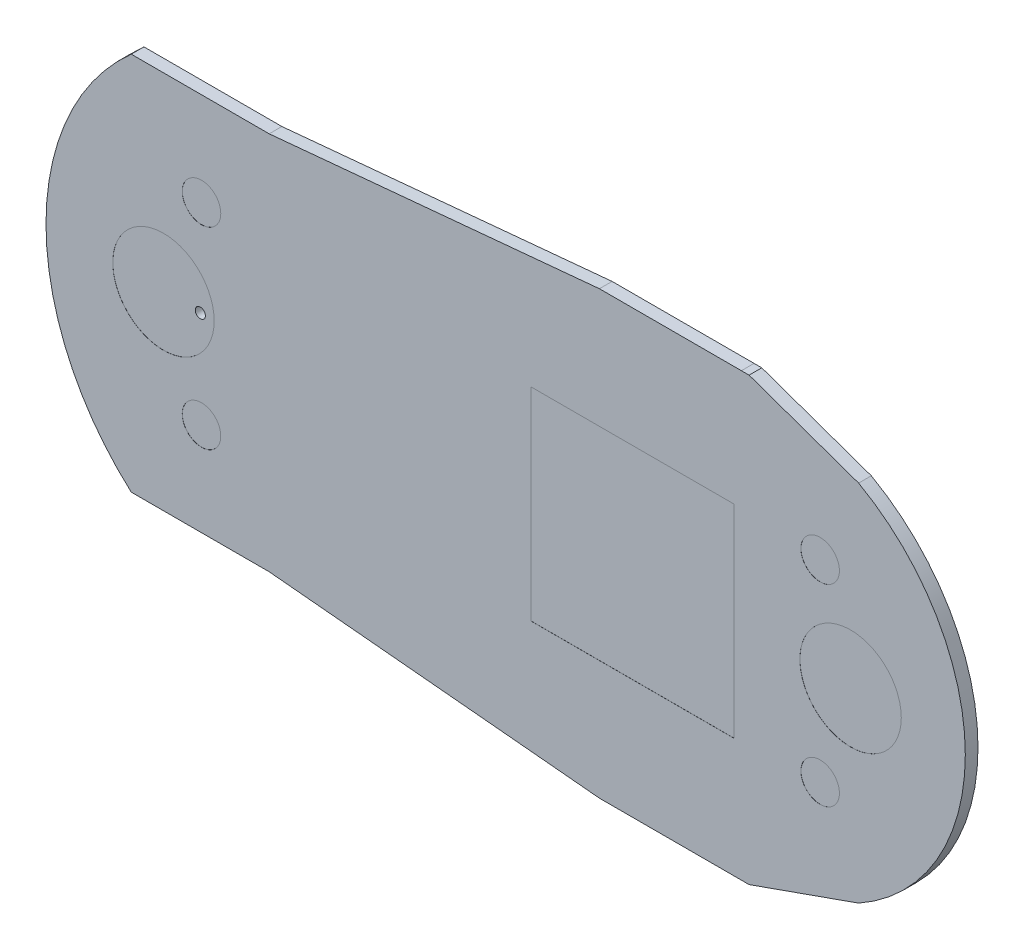
ISO-10303-21;
HEADER;
FILE_DESCRIPTION(('STEP AP214'),'2;1');
FILE_NAME('part.step','',(''),(''),'','','');
FILE_SCHEMA(('AUTOMOTIVE_DESIGN { 1 0 10303 214 1 1 1 1 }'));
ENDSEC;
DATA;
#1=APPLICATION_CONTEXT('core data for automotive mechanical design processes');
#2=APPLICATION_PROTOCOL_DEFINITION('international standard','automotive_design',2000,#1);
#3=PRODUCT_CONTEXT('',#1,'mechanical');
#4=PRODUCT('Part','Part','',(#3));
#5=PRODUCT_RELATED_PRODUCT_CATEGORY('part','',(#4));
#6=PRODUCT_DEFINITION_FORMATION('','',#4);
#7=PRODUCT_DEFINITION_CONTEXT('part definition',#1,'design');
#8=PRODUCT_DEFINITION('design','',#6,#7);
#9=PRODUCT_DEFINITION_SHAPE('','',#8);
#10=(LENGTH_UNIT() NAMED_UNIT(*) SI_UNIT(.MILLI.,.METRE.));
#11=(NAMED_UNIT(*) PLANE_ANGLE_UNIT() SI_UNIT($,.RADIAN.));
#12=(NAMED_UNIT(*) SI_UNIT($,.STERADIAN.) SOLID_ANGLE_UNIT());
#13=UNCERTAINTY_MEASURE_WITH_UNIT(LENGTH_MEASURE(1.E-05),#10,'distance_accuracy_value','');
#14=(GEOMETRIC_REPRESENTATION_CONTEXT(3) GLOBAL_UNCERTAINTY_ASSIGNED_CONTEXT((#13)) GLOBAL_UNIT_ASSIGNED_CONTEXT((#10,
#11,#12)) REPRESENTATION_CONTEXT('',''));
#15=CARTESIAN_POINT('',(0.,0.,0.));
#16=DIRECTION('',(0.,0.,1.));
#17=DIRECTION('',(1.,0.,0.));
#18=AXIS2_PLACEMENT_3D('',#15,#16,#17);
#19=CARTESIAN_POINT('',(122.626549398508,-30.4550148476976,-35.39998));
#20=DIRECTION('',(0.,0.,-1.));
#21=DIRECTION('',(-1.,0.,0.));
#22=AXIS2_PLACEMENT_3D('',#19,#20,#21);
#23=PLANE('',#22);
#24=DIRECTION('',(-0.995634568949673,-0.0933370511233262,0.));
#25=VECTOR('',#24,1.);
#26=CARTESIAN_POINT('',(61.5582408342437,55.2511691061694,-35.39998));
#27=LINE('',#26,#25);
#28=CARTESIAN_POINT('',(61.5582408342434,55.2511691061693,-35.39998));
#29=VERTEX_POINT('',#28);
#30=CARTESIAN_POINT('',(-21.1455,47.4979998942169,-35.39998));
#31=VERTEX_POINT('',#30);
#32=EDGE_CURVE('E184',#29,#31,#27,.T.);
#33=ORIENTED_EDGE('',*,*,#32,.F.);
#34=DIRECTION('',(1.,0.,0.));
#35=VECTOR('',#34,1.);
#36=CARTESIAN_POINT('',(61.5582408342434,55.2511691061693,-35.39998));
#37=LINE('',#36,#35);
#38=CARTESIAN_POINT('',(97.1182408342434,55.2511691061693,-35.39998));
#39=VERTEX_POINT('',#38);
#40=EDGE_CURVE('E280',#29,#39,#37,.T.);
#41=ORIENTED_EDGE('',*,*,#40,.T.);
#42=DIRECTION('',(-0.999999993576027,0.000113348779275702,0.));
#43=VECTOR('',#42,1.);
#44=CARTESIAN_POINT('',(99.0433171406937,55.2509509011186,-35.39998));
#45=LINE('',#44,#43);
#46=CARTESIAN_POINT('',(99.0433171406937,55.2509509011186,-35.39998));
#47=VERTEX_POINT('',#46);
#48=EDGE_CURVE('E185',#47,#39,#45,.T.);
#49=ORIENTED_EDGE('',*,*,#48,.F.);
#50=DIRECTION('',(-0.942838845512373,0.333249023093687,0.));
#51=VECTOR('',#50,1.);
#52=CARTESIAN_POINT('',(126.475317140709,45.5550338894014,-35.39998));
#53=LINE('',#52,#51);
#54=CARTESIAN_POINT('',(126.475317140709,45.5550338894014,-35.39998));
#55=VERTEX_POINT('',#54);
#56=EDGE_CURVE('E298',#55,#47,#53,.T.);
#57=ORIENTED_EDGE('',*,*,#56,.F.);
#58=CARTESIAN_POINT('',(101.009015662051,0.,-35.39998));
#59=DIRECTION('',(0.,0.,-1.));
#60=DIRECTION('',(-1.,0.,0.));
#61=AXIS2_PLACEMENT_3D('',#58,#59,#60);
#62=CIRCLE('',#61,52.1899762757795);
#63=CARTESIAN_POINT('',(126.475317140709,-45.5550338894012,-35.39998));
#64=VERTEX_POINT('',#63);
#65=EDGE_CURVE('E303',#64,#55,#62,.F.);
#66=ORIENTED_EDGE('',*,*,#65,.F.);
#67=DIRECTION('',(0.942838845512372,0.333249023093688,0.));
#68=VECTOR('',#67,1.);
#69=CARTESIAN_POINT('',(99.0433171406938,-55.2509509011184,-35.39998));
#70=LINE('',#69,#68);
#71=CARTESIAN_POINT('',(99.0433171406938,-55.2509509011184,-35.39998));
#72=VERTEX_POINT('',#71);
#73=EDGE_CURVE('E307',#72,#64,#70,.T.);
#74=ORIENTED_EDGE('',*,*,#73,.F.);
#75=DIRECTION('',(0.999999993576027,0.000113348779272105,0.));
#76=VECTOR('',#75,1.);
#77=CARTESIAN_POINT('',(97.1182408342439,-55.2511691061692,-35.39998));
#78=LINE('',#77,#76);
#79=CARTESIAN_POINT('',(97.1182408342439,-55.2511691061692,-35.39998));
#80=VERTEX_POINT('',#79);
#81=EDGE_CURVE('E312',#80,#72,#78,.T.);
#82=ORIENTED_EDGE('',*,*,#81,.F.);
#83=DIRECTION('',(1.,0.,0.));
#84=VECTOR('',#83,1.);
#85=CARTESIAN_POINT('',(61.5582408342434,-55.2511691061693,-35.39998));
#86=LINE('',#85,#84);
#87=CARTESIAN_POINT('',(61.5582408342437,-55.2511691061692,-35.39998));
#88=VERTEX_POINT('',#87);
#89=EDGE_CURVE('E358',#88,#80,#86,.T.);
#90=ORIENTED_EDGE('',*,*,#89,.F.);
#91=DIRECTION('',(0.995634568949674,-0.0933370511233254,0.));
#92=VECTOR('',#91,1.);
#93=CARTESIAN_POINT('',(-21.1454999999997,-47.4979998942169,-35.39998));
#94=LINE('',#93,#92);
#95=CARTESIAN_POINT('',(-21.1454999999997,-47.4979998942169,-35.39998));
#96=VERTEX_POINT('',#95);
#97=EDGE_CURVE('E188',#96,#88,#94,.T.);
#98=ORIENTED_EDGE('',*,*,#97,.F.);
#99=DIRECTION('',(1.,0.,0.));
#100=VECTOR('',#99,1.);
#101=CARTESIAN_POINT('',(-27.94,-47.4979998942169,-35.39998));
#102=LINE('',#101,#100);
#103=CARTESIAN_POINT('',(-55.6894999999997,-47.4979998942169,-35.39998));
#104=VERTEX_POINT('',#103);
#105=EDGE_CURVE('E202',#104,#96,#102,.T.);
#106=ORIENTED_EDGE('',*,*,#105,.F.);
#107=CARTESIAN_POINT('',(-13.5446307268727,0.,-35.39998));
#108=DIRECTION('',(0.,0.,-1.));
#109=DIRECTION('',(-1.,0.,0.));
#110=AXIS2_PLACEMENT_3D('',#107,#108,#109);
#111=CIRCLE('',#110,63.5);
#112=CARTESIAN_POINT('',(-55.6894999999997,47.4979998942169,-35.39998));
#113=VERTEX_POINT('',#112);
#114=EDGE_CURVE('E337',#113,#104,#111,.F.);
#115=ORIENTED_EDGE('',*,*,#114,.F.);
#116=DIRECTION('',(1.,0.,0.));
#117=VECTOR('',#116,1.);
#118=CARTESIAN_POINT('',(-48.895,47.4979998942169,-35.39998));
#119=LINE('',#118,#117);
#120=EDGE_CURVE('E175',#113,#31,#119,.T.);
#121=ORIENTED_EDGE('',*,*,#120,.T.);
#122=EDGE_LOOP('',(#33,#41,#49,#57,#66,#74,#82,#90,#98,#106,#115,#121));
#123=FACE_BOUND('',#122,.T.);
#124=ADVANCED_FACE('F50',(#123),#23,.T.);
#125=CARTESIAN_POINT('',(122.626549398508,-30.4550148476976,-32.22498));
#126=DIRECTION('',(0.,0.,-1.));
#127=DIRECTION('',(-1.,0.,0.));
#128=AXIS2_PLACEMENT_3D('',#125,#126,#127);
#129=PLANE('',#128);
#130=CARTESIAN_POINT('',(-13.5446307268727,0.,-32.22498));
#131=DIRECTION('',(0.,0.,1.));
#132=DIRECTION('',(1.,0.,0.));
#133=AXIS2_PLACEMENT_3D('',#130,#131,#132);
#134=CIRCLE('',#133,63.5);
#135=CARTESIAN_POINT('',(-55.6895,47.4979998942169,-32.22498));
#136=VERTEX_POINT('',#135);
#137=CARTESIAN_POINT('',(-55.6894999999997,-47.4979998942169,-32.22498));
#138=VERTEX_POINT('',#137);
#139=EDGE_CURVE('E327',#136,#138,#134,.T.);
#140=ORIENTED_EDGE('',*,*,#139,.T.);
#141=DIRECTION('',(1.,0.,0.));
#142=VECTOR('',#141,1.);
#143=CARTESIAN_POINT('',(-27.94,-47.4979998942169,-32.22498));
#144=LINE('',#143,#142);
#145=CARTESIAN_POINT('',(-21.1455,-47.4979998942169,-32.22498));
#146=VERTEX_POINT('',#145);
#147=EDGE_CURVE('E209',#138,#146,#144,.T.);
#148=ORIENTED_EDGE('',*,*,#147,.T.);
#149=DIRECTION('',(0.995634568949673,-0.0933370511233254,0.));
#150=VECTOR('',#149,1.);
#151=CARTESIAN_POINT('',(-21.1454999999997,-47.4979998942169,-32.22498));
#152=LINE('',#151,#150);
#153=CARTESIAN_POINT('',(61.5582408342437,-55.2511691061692,-32.22498));
#154=VERTEX_POINT('',#153);
#155=EDGE_CURVE('E190',#146,#154,#152,.T.);
#156=ORIENTED_EDGE('',*,*,#155,.T.);
#157=DIRECTION('',(-1.,0.,0.));
#158=VECTOR('',#157,1.);
#159=CARTESIAN_POINT('',(61.5582408342434,-55.2511691061693,-32.22498));
#160=LINE('',#159,#158);
#161=CARTESIAN_POINT('',(97.1182408342439,-55.2511691061692,-32.22498));
#162=VERTEX_POINT('',#161);
#163=EDGE_CURVE('E59',#162,#154,#160,.T.);
#164=ORIENTED_EDGE('',*,*,#163,.F.);
#165=DIRECTION('',(0.999999993576027,0.000113348779272105,0.));
#166=VECTOR('',#165,1.);
#167=CARTESIAN_POINT('',(97.1182408342439,-55.2511691061692,-32.22498));
#168=LINE('',#167,#166);
#169=CARTESIAN_POINT('',(99.0433171406938,-55.2509509011184,-32.22498));
#170=VERTEX_POINT('',#169);
#171=EDGE_CURVE('E348',#162,#170,#168,.T.);
#172=ORIENTED_EDGE('',*,*,#171,.T.);
#173=DIRECTION('',(0.942838845512372,0.333249023093688,0.));
#174=VECTOR('',#173,1.);
#175=CARTESIAN_POINT('',(99.0433171406938,-55.2509509011184,-32.22498));
#176=LINE('',#175,#174);
#177=CARTESIAN_POINT('',(126.475317140709,-45.5550338894012,-32.22498));
#178=VERTEX_POINT('',#177);
#179=EDGE_CURVE('E346',#170,#178,#176,.T.);
#180=ORIENTED_EDGE('',*,*,#179,.T.);
#181=CARTESIAN_POINT('',(101.009015662051,0.,-32.22498));
#182=DIRECTION('',(0.,0.,1.));
#183=DIRECTION('',(1.,0.,0.));
#184=AXIS2_PLACEMENT_3D('',#181,#182,#183);
#185=CIRCLE('',#184,52.1899762757795);
#186=CARTESIAN_POINT('',(126.475317140709,45.5550338894014,-32.22498));
#187=VERTEX_POINT('',#186);
#188=EDGE_CURVE('E343',#178,#187,#185,.T.);
#189=ORIENTED_EDGE('',*,*,#188,.T.);
#190=DIRECTION('',(-0.942838845512372,0.333249023093687,0.));
#191=VECTOR('',#190,1.);
#192=CARTESIAN_POINT('',(126.475317140709,45.5550338894014,-32.22498));
#193=LINE('',#192,#191);
#194=CARTESIAN_POINT('',(99.0433171406937,55.2509509011186,-32.22498));
#195=VERTEX_POINT('',#194);
#196=EDGE_CURVE('E316',#187,#195,#193,.T.);
#197=ORIENTED_EDGE('',*,*,#196,.T.);
#198=DIRECTION('',(-0.999999993576027,0.000113348779275702,0.));
#199=VECTOR('',#198,1.);
#200=CARTESIAN_POINT('',(99.0433171406937,55.2509509011186,-32.22498));
#201=LINE('',#200,#199);
#202=CARTESIAN_POINT('',(97.1182408342437,55.2511691061694,-32.22498));
#203=VERTEX_POINT('',#202);
#204=EDGE_CURVE('E296',#195,#203,#201,.T.);
#205=ORIENTED_EDGE('',*,*,#204,.T.);
#206=DIRECTION('',(-1.,0.,0.));
#207=VECTOR('',#206,1.);
#208=CARTESIAN_POINT('',(61.5582408342434,55.2511691061693,-32.22498));
#209=LINE('',#208,#207);
#210=CARTESIAN_POINT('',(61.5582408342434,55.2511691061693,-32.22498));
#211=VERTEX_POINT('',#210);
#212=EDGE_CURVE('E74',#203,#211,#209,.T.);
#213=ORIENTED_EDGE('',*,*,#212,.T.);
#214=DIRECTION('',(-0.995634568949673,-0.0933370511233262,0.));
#215=VECTOR('',#214,1.);
#216=CARTESIAN_POINT('',(61.5582408342437,55.2511691061694,-32.22498));
#217=LINE('',#216,#215);
#218=CARTESIAN_POINT('',(-21.1454999999997,47.497999894217,-32.22498));
#219=VERTEX_POINT('',#218);
#220=EDGE_CURVE('E182',#211,#219,#217,.T.);
#221=ORIENTED_EDGE('',*,*,#220,.T.);
#222=DIRECTION('',(1.,0.,0.));
#223=VECTOR('',#222,1.);
#224=CARTESIAN_POINT('',(-48.895,47.4979998942169,-32.22498));
#225=LINE('',#224,#223);
#226=EDGE_CURVE('E166',#136,#219,#225,.T.);
#227=ORIENTED_EDGE('',*,*,#226,.F.);
#228=EDGE_LOOP('',(#140,#148,#156,#164,#172,#180,#189,#197,#205,#213,#221,#227));
#229=FACE_BOUND('',#228,.T.);
#230=CARTESIAN_POINT('',(-38.1,24.13,-32.22498));
#231=DIRECTION('',(0.,0.,1.));
#232=DIRECTION('',(1.,0.,0.));
#233=AXIS2_PLACEMENT_3D('',#230,#231,#232);
#234=CIRCLE('',#233,4.82599999999999);
#235=CARTESIAN_POINT('',(-33.274,24.13,-32.22498));
#236=VERTEX_POINT('',#235);
#237=EDGE_CURVE('E230',#236,#236,#234,.T.);
#238=ORIENTED_EDGE('',*,*,#237,.F.);
#239=EDGE_LOOP('',(#238));
#240=FACE_BOUND('',#239,.T.);
#241=CARTESIAN_POINT('',(124.46,0.,-32.22498));
#242=DIRECTION('',(0.,0.,1.));
#243=DIRECTION('',(1.,0.,0.));
#244=AXIS2_PLACEMENT_3D('',#241,#242,#243);
#245=CIRCLE('',#244,12.7);
#246=CARTESIAN_POINT('',(137.16,0.,-32.22498));
#247=VERTEX_POINT('',#246);
#248=EDGE_CURVE('E222',#247,#247,#245,.T.);
#249=ORIENTED_EDGE('',*,*,#248,.F.);
#250=EDGE_LOOP('',(#249));
#251=FACE_BOUND('',#250,.T.);
#252=CARTESIAN_POINT('',(-47.625,0.,-32.22498));
#253=DIRECTION('',(0.,0.,1.));
#254=DIRECTION('',(1.,0.,0.));
#255=AXIS2_PLACEMENT_3D('',#252,#253,#254);
#256=CIRCLE('',#255,12.7);
#257=CARTESIAN_POINT('',(-34.925,0.,-32.22498));
#258=VERTEX_POINT('',#257);
#259=EDGE_CURVE('E215',#258,#258,#256,.T.);
#260=ORIENTED_EDGE('',*,*,#259,.F.);
#261=EDGE_LOOP('',(#260));
#262=FACE_BOUND('',#261,.T.);
#263=DIRECTION('',(-1.,0.,0.));
#264=VECTOR('',#263,1.);
#265=CARTESIAN_POINT('',(44.45,25.4,-32.22498));
#266=LINE('',#265,#264);
#267=CARTESIAN_POINT('',(95.25,25.4,-32.22498));
#268=VERTEX_POINT('',#267);
#269=CARTESIAN_POINT('',(44.45,25.4,-32.22498));
#270=VERTEX_POINT('',#269);
#271=EDGE_CURVE('E261',#268,#270,#266,.T.);
#272=ORIENTED_EDGE('',*,*,#271,.F.);
#273=DIRECTION('',(0.,1.,0.));
#274=VECTOR('',#273,1.);
#275=CARTESIAN_POINT('',(95.25,-25.4,-32.22498));
#276=LINE('',#275,#274);
#277=CARTESIAN_POINT('',(95.25,-25.4,-32.22498));
#278=VERTEX_POINT('',#277);
#279=EDGE_CURVE('E66',#278,#268,#276,.T.);
#280=ORIENTED_EDGE('',*,*,#279,.F.);
#281=DIRECTION('',(1.,0.,0.));
#282=VECTOR('',#281,1.);
#283=CARTESIAN_POINT('',(44.45,-25.4,-32.22498));
#284=LINE('',#283,#282);
#285=CARTESIAN_POINT('',(44.45,-25.4,-32.22498));
#286=VERTEX_POINT('',#285);
#287=EDGE_CURVE('E254',#286,#278,#284,.T.);
#288=ORIENTED_EDGE('',*,*,#287,.F.);
#289=DIRECTION('',(0.,-1.,0.));
#290=VECTOR('',#289,1.);
#291=CARTESIAN_POINT('',(44.45,-25.4,-32.22498));
#292=LINE('',#291,#290);
#293=EDGE_CURVE('E257',#270,#286,#292,.T.);
#294=ORIENTED_EDGE('',*,*,#293,.F.);
#295=EDGE_LOOP('',(#272,#280,#288,#294));
#296=FACE_BOUND('',#295,.T.);
#297=CARTESIAN_POINT('',(-38.1,-24.13,-32.22498));
#298=DIRECTION('',(0.,0.,1.));
#299=DIRECTION('',(-1.,0.,0.));
#300=AXIS2_PLACEMENT_3D('',#297,#298,#299);
#301=CIRCLE('',#300,4.82599999999999);
#302=CARTESIAN_POINT('',(-42.926,-24.13,-32.22498));
#303=VERTEX_POINT('',#302);
#304=EDGE_CURVE('E240',#303,#303,#301,.T.);
#305=ORIENTED_EDGE('',*,*,#304,.F.);
#306=EDGE_LOOP('',(#305));
#307=FACE_BOUND('',#306,.T.);
#308=CARTESIAN_POINT('',(116.84,-24.13,-32.22498));
#309=DIRECTION('',(0.,0.,1.));
#310=DIRECTION('',(-1.,0.,0.));
#311=AXIS2_PLACEMENT_3D('',#308,#309,#310);
#312=CIRCLE('',#311,4.82599999999999);
#313=CARTESIAN_POINT('',(112.014,-24.13,-32.22498));
#314=VERTEX_POINT('',#313);
#315=EDGE_CURVE('E234',#314,#314,#312,.T.);
#316=ORIENTED_EDGE('',*,*,#315,.F.);
#317=EDGE_LOOP('',(#316));
#318=FACE_BOUND('',#317,.T.);
#319=CARTESIAN_POINT('',(116.84,24.13,-32.22498));
#320=DIRECTION('',(0.,0.,1.));
#321=DIRECTION('',(1.,0.,0.));
#322=AXIS2_PLACEMENT_3D('',#319,#320,#321);
#323=CIRCLE('',#322,4.82599999999999);
#324=CARTESIAN_POINT('',(121.666,24.13,-32.22498));
#325=VERTEX_POINT('',#324);
#326=EDGE_CURVE('E227',#325,#325,#323,.T.);
#327=ORIENTED_EDGE('',*,*,#326,.F.);
#328=EDGE_LOOP('',(#327));
#329=FACE_BOUND('',#328,.T.);
#330=ADVANCED_FACE('F52',(#229,#240,#251,#262,#296,#307,#318,#329),#129,.F.);
#331=CARTESIAN_POINT('',(61.5582408342434,-55.2511691061693,9.23690671004311));
#332=DIRECTION('',(0.,1.,0.));
#333=DIRECTION('',(0.,0.,1.));
#334=AXIS2_PLACEMENT_3D('',#331,#332,#333);
#335=PLANE('',#334);
#336=DIRECTION('',(0.,0.,-1.));
#337=VECTOR('',#336,1.);
#338=CARTESIAN_POINT('',(97.1182408342434,-55.2511691061693,9.23690671004311));
#339=LINE('',#338,#337);
#340=EDGE_CURVE('E361',#162,#80,#339,.T.);
#341=ORIENTED_EDGE('',*,*,#340,.F.);
#342=ORIENTED_EDGE('',*,*,#163,.T.);
#343=DIRECTION('',(0.,0.,-1.));
#344=VECTOR('',#343,1.);
#345=CARTESIAN_POINT('',(61.5582408342434,-55.2511691061693,9.23690671004311));
#346=LINE('',#345,#344);
#347=EDGE_CURVE('E336',#154,#88,#346,.T.);
#348=ORIENTED_EDGE('',*,*,#347,.T.);
#349=ORIENTED_EDGE('',*,*,#89,.T.);
#350=EDGE_LOOP('',(#341,#342,#348,#349));
#351=FACE_BOUND('',#350,.T.);
#352=ADVANCED_FACE('F370',(#351),#335,.F.);
#353=CARTESIAN_POINT('',(61.5582408342434,55.2511691061693,9.23690671004311));
#354=DIRECTION('',(0.,1.,0.));
#355=DIRECTION('',(0.,0.,1.));
#356=AXIS2_PLACEMENT_3D('',#353,#354,#355);
#357=PLANE('',#356);
#358=ORIENTED_EDGE('',*,*,#212,.F.);
#359=DIRECTION('',(0.,0.,-1.));
#360=VECTOR('',#359,1.);
#361=CARTESIAN_POINT('',(97.1182408342434,55.2511691061693,9.23690671004311));
#362=LINE('',#361,#360);
#363=EDGE_CURVE('E357',#203,#39,#362,.T.);
#364=ORIENTED_EDGE('',*,*,#363,.T.);
#365=ORIENTED_EDGE('',*,*,#40,.F.);
#366=DIRECTION('',(0.,0.,-1.));
#367=VECTOR('',#366,1.);
#368=CARTESIAN_POINT('',(61.5582408342434,55.2511691061693,9.23690671004311));
#369=LINE('',#368,#367);
#370=EDGE_CURVE('E284',#211,#29,#369,.T.);
#371=ORIENTED_EDGE('',*,*,#370,.F.);
#372=EDGE_LOOP('',(#358,#364,#365,#371));
#373=FACE_BOUND('',#372,.T.);
#374=ADVANCED_FACE('F356',(#373),#357,.T.);
#375=CARTESIAN_POINT('',(-38.1,24.13,-32.25038));
#376=DIRECTION('',(0.,0.,1.));
#377=DIRECTION('',(1.,0.,0.));
#378=AXIS2_PLACEMENT_3D('',#375,#376,#377);
#379=CYLINDRICAL_SURFACE('',#378,4.82599999999999);
#380=CARTESIAN_POINT('',(-38.1,24.13,-32.25038));
#381=DIRECTION('',(0.,0.,1.));
#382=DIRECTION('',(1.,0.,0.));
#383=AXIS2_PLACEMENT_3D('',#380,#381,#382);
#384=CIRCLE('',#383,4.82599999999999);
#385=CARTESIAN_POINT('',(-33.274,24.13,-32.25038));
#386=VERTEX_POINT('',#385);
#387=EDGE_CURVE('E275',#386,#386,#384,.T.);
#388=ORIENTED_EDGE('',*,*,#387,.F.);
#389=EDGE_LOOP('',(#388));
#390=FACE_BOUND('',#389,.T.);
#391=ORIENTED_EDGE('',*,*,#237,.T.);
#392=EDGE_LOOP('',(#391));
#393=FACE_BOUND('',#392,.T.);
#394=ADVANCED_FACE('F411',(#390,#393),#379,.F.);
#395=CARTESIAN_POINT('',(-38.1,24.13,-32.25038));
#396=DIRECTION('',(0.,0.,1.));
#397=DIRECTION('',(1.,0.,0.));
#398=AXIS2_PLACEMENT_3D('',#395,#396,#397);
#399=PLANE('',#398);
#400=ORIENTED_EDGE('',*,*,#387,.T.);
#401=EDGE_LOOP('',(#400));
#402=FACE_BOUND('',#401,.T.);
#403=ADVANCED_FACE('F414',(#402),#399,.T.);
#404=CARTESIAN_POINT('',(124.46,0.,-32.25038));
#405=DIRECTION('',(0.,0.,1.));
#406=DIRECTION('',(1.,0.,0.));
#407=AXIS2_PLACEMENT_3D('',#404,#405,#406);
#408=CYLINDRICAL_SURFACE('',#407,12.7);
#409=CARTESIAN_POINT('',(124.46,0.,-32.25038));
#410=DIRECTION('',(0.,0.,1.));
#411=DIRECTION('',(1.,0.,0.));
#412=AXIS2_PLACEMENT_3D('',#409,#410,#411);
#413=CIRCLE('',#412,12.7);
#414=CARTESIAN_POINT('',(137.16,0.,-32.25038));
#415=VERTEX_POINT('',#414);
#416=EDGE_CURVE('E214',#415,#415,#413,.T.);
#417=ORIENTED_EDGE('',*,*,#416,.F.);
#418=EDGE_LOOP('',(#417));
#419=FACE_BOUND('',#418,.T.);
#420=ORIENTED_EDGE('',*,*,#248,.T.);
#421=EDGE_LOOP('',(#420));
#422=FACE_BOUND('',#421,.T.);
#423=ADVANCED_FACE('F418',(#419,#422),#408,.F.);
#424=CARTESIAN_POINT('',(124.46,0.,-32.25038));
#425=DIRECTION('',(0.,0.,1.));
#426=DIRECTION('',(1.,0.,0.));
#427=AXIS2_PLACEMENT_3D('',#424,#425,#426);
#428=PLANE('',#427);
#429=ORIENTED_EDGE('',*,*,#416,.T.);
#430=EDGE_LOOP('',(#429));
#431=FACE_BOUND('',#430,.T.);
#432=ADVANCED_FACE('F463',(#431),#428,.T.);
#433=CARTESIAN_POINT('',(-47.625,0.,-32.25038));
#434=DIRECTION('',(0.,0.,1.));
#435=DIRECTION('',(1.,0.,0.));
#436=AXIS2_PLACEMENT_3D('',#433,#434,#435);
#437=PLANE('',#436);
#438=CARTESIAN_POINT('',(-47.625,0.,-32.25038));
#439=DIRECTION('',(0.,0.,1.));
#440=DIRECTION('',(1.,0.,0.));
#441=AXIS2_PLACEMENT_3D('',#438,#439,#440);
#442=CIRCLE('',#441,12.7);
#443=CARTESIAN_POINT('',(-34.925,0.,-32.25038));
#444=VERTEX_POINT('',#443);
#445=EDGE_CURVE('E219',#444,#444,#442,.T.);
#446=ORIENTED_EDGE('',*,*,#445,.T.);
#447=EDGE_LOOP('',(#446));
#448=FACE_BOUND('',#447,.T.);
#449=CARTESIAN_POINT('',(-38.4175,0.,-32.25038));
#450=DIRECTION('',(0.,0.,1.));
#451=DIRECTION('',(1.,0.,0.));
#452=AXIS2_PLACEMENT_3D('',#449,#450,#451);
#453=CIRCLE('',#452,1.27);
#454=CARTESIAN_POINT('',(-37.1475,0.,-32.25038));
#455=VERTEX_POINT('',#454);
#456=EDGE_CURVE('E54',#455,#455,#453,.F.);
#457=ORIENTED_EDGE('',*,*,#456,.T.);
#458=EDGE_LOOP('',(#457));
#459=FACE_BOUND('',#458,.T.);
#460=ADVANCED_FACE('F466',(#448,#459),#437,.T.);
#461=CARTESIAN_POINT('',(-47.625,0.,-32.25038));
#462=DIRECTION('',(0.,0.,1.));
#463=DIRECTION('',(1.,0.,0.));
#464=AXIS2_PLACEMENT_3D('',#461,#462,#463);
#465=CYLINDRICAL_SURFACE('',#464,12.7);
#466=ORIENTED_EDGE('',*,*,#445,.F.);
#467=EDGE_LOOP('',(#466));
#468=FACE_BOUND('',#467,.T.);
#469=ORIENTED_EDGE('',*,*,#259,.T.);
#470=EDGE_LOOP('',(#469));
#471=FACE_BOUND('',#470,.T.);
#472=ADVANCED_FACE('F440',(#468,#471),#465,.F.);
#473=CARTESIAN_POINT('',(95.25,-25.4,-32.25038));
#474=DIRECTION('',(1.,0.,0.));
#475=DIRECTION('',(0.,0.,-1.));
#476=AXIS2_PLACEMENT_3D('',#473,#474,#475);
#477=PLANE('',#476);
#478=ORIENTED_EDGE('',*,*,#279,.T.);
#479=DIRECTION('',(0.,0.,1.));
#480=VECTOR('',#479,1.);
#481=CARTESIAN_POINT('',(95.25,25.4,-32.25038));
#482=LINE('',#481,#480);
#483=CARTESIAN_POINT('',(95.25,25.4,-32.25038));
#484=VERTEX_POINT('',#483);
#485=EDGE_CURVE('E246',#484,#268,#482,.T.);
#486=ORIENTED_EDGE('',*,*,#485,.F.);
#487=DIRECTION('',(0.,1.,0.));
#488=VECTOR('',#487,1.);
#489=CARTESIAN_POINT('',(95.25,-25.4,-32.25038));
#490=LINE('',#489,#488);
#491=CARTESIAN_POINT('',(95.25,-25.4,-32.25038));
#492=VERTEX_POINT('',#491);
#493=EDGE_CURVE('E258',#492,#484,#490,.T.);
#494=ORIENTED_EDGE('',*,*,#493,.F.);
#495=DIRECTION('',(0.,0.,1.));
#496=VECTOR('',#495,1.);
#497=CARTESIAN_POINT('',(95.25,-25.4,-32.25038));
#498=LINE('',#497,#496);
#499=EDGE_CURVE('E218',#492,#278,#498,.T.);
#500=ORIENTED_EDGE('',*,*,#499,.T.);
#501=EDGE_LOOP('',(#478,#486,#494,#500));
#502=FACE_BOUND('',#501,.T.);
#503=ADVANCED_FACE('F430',(#502),#477,.F.);
#504=CARTESIAN_POINT('',(44.45,-25.4,-32.25038));
#505=DIRECTION('',(0.,-1.,0.));
#506=DIRECTION('',(1.,0.,0.));
#507=AXIS2_PLACEMENT_3D('',#504,#505,#506);
#508=PLANE('',#507);
#509=ORIENTED_EDGE('',*,*,#287,.T.);
#510=ORIENTED_EDGE('',*,*,#499,.F.);
#511=DIRECTION('',(1.,0.,0.));
#512=VECTOR('',#511,1.);
#513=CARTESIAN_POINT('',(44.45,-25.4,-32.25038));
#514=LINE('',#513,#512);
#515=CARTESIAN_POINT('',(44.45,-25.4,-32.25038));
#516=VERTEX_POINT('',#515);
#517=EDGE_CURVE('E248',#516,#492,#514,.T.);
#518=ORIENTED_EDGE('',*,*,#517,.F.);
#519=DIRECTION('',(0.,0.,1.));
#520=VECTOR('',#519,1.);
#521=CARTESIAN_POINT('',(44.45,-25.4,-32.25038));
#522=LINE('',#521,#520);
#523=EDGE_CURVE('E251',#516,#286,#522,.T.);
#524=ORIENTED_EDGE('',*,*,#523,.T.);
#525=EDGE_LOOP('',(#509,#510,#518,#524));
#526=FACE_BOUND('',#525,.T.);
#527=ADVANCED_FACE('F426',(#526),#508,.F.);
#528=CARTESIAN_POINT('',(44.45,-25.4,-32.25038));
#529=DIRECTION('',(-1.,0.,0.));
#530=DIRECTION('',(0.,0.,1.));
#531=AXIS2_PLACEMENT_3D('',#528,#529,#530);
#532=PLANE('',#531);
#533=ORIENTED_EDGE('',*,*,#293,.T.);
#534=ORIENTED_EDGE('',*,*,#523,.F.);
#535=DIRECTION('',(0.,-1.,0.));
#536=VECTOR('',#535,1.);
#537=CARTESIAN_POINT('',(44.45,-25.4,-32.25038));
#538=LINE('',#537,#536);
#539=CARTESIAN_POINT('',(44.45,25.4,-32.25038));
#540=VERTEX_POINT('',#539);
#541=EDGE_CURVE('E267',#540,#516,#538,.T.);
#542=ORIENTED_EDGE('',*,*,#541,.F.);
#543=DIRECTION('',(0.,0.,1.));
#544=VECTOR('',#543,1.);
#545=CARTESIAN_POINT('',(44.45,25.4,-32.25038));
#546=LINE('',#545,#544);
#547=EDGE_CURVE('E249',#540,#270,#546,.T.);
#548=ORIENTED_EDGE('',*,*,#547,.T.);
#549=EDGE_LOOP('',(#533,#534,#542,#548));
#550=FACE_BOUND('',#549,.T.);
#551=ADVANCED_FACE('F429',(#550),#532,.F.);
#552=CARTESIAN_POINT('',(44.45,25.4,-32.25038));
#553=DIRECTION('',(0.,1.,0.));
#554=DIRECTION('',(0.,0.,1.));
#555=AXIS2_PLACEMENT_3D('',#552,#553,#554);
#556=PLANE('',#555);
#557=ORIENTED_EDGE('',*,*,#271,.T.);
#558=ORIENTED_EDGE('',*,*,#547,.F.);
#559=DIRECTION('',(-1.,0.,0.));
#560=VECTOR('',#559,1.);
#561=CARTESIAN_POINT('',(44.45,25.4,-32.25038));
#562=LINE('',#561,#560);
#563=EDGE_CURVE('E270',#484,#540,#562,.T.);
#564=ORIENTED_EDGE('',*,*,#563,.F.);
#565=ORIENTED_EDGE('',*,*,#485,.T.);
#566=EDGE_LOOP('',(#557,#558,#564,#565));
#567=FACE_BOUND('',#566,.T.);
#568=ADVANCED_FACE('F424',(#567),#556,.F.);
#569=CARTESIAN_POINT('',(0.,0.,-32.25038));
#570=DIRECTION('',(0.,0.,-1.));
#571=DIRECTION('',(-1.,0.,0.));
#572=AXIS2_PLACEMENT_3D('',#569,#570,#571);
#573=PLANE('',#572);
#574=ORIENTED_EDGE('',*,*,#493,.T.);
#575=ORIENTED_EDGE('',*,*,#563,.T.);
#576=ORIENTED_EDGE('',*,*,#541,.T.);
#577=ORIENTED_EDGE('',*,*,#517,.T.);
#578=EDGE_LOOP('',(#574,#575,#576,#577));
#579=FACE_BOUND('',#578,.T.);
#580=ADVANCED_FACE('F420',(#579),#573,.F.);
#581=CARTESIAN_POINT('',(-38.1,-24.13,-32.25038));
#582=DIRECTION('',(0.,0.,1.));
#583=DIRECTION('',(1.,0.,0.));
#584=AXIS2_PLACEMENT_3D('',#581,#582,#583);
#585=CYLINDRICAL_SURFACE('',#584,4.82599999999999);
#586=CARTESIAN_POINT('',(-38.1,-24.13,-32.25038));
#587=DIRECTION('',(0.,0.,1.));
#588=DIRECTION('',(-1.,0.,0.));
#589=AXIS2_PLACEMENT_3D('',#586,#587,#588);
#590=CIRCLE('',#589,4.82599999999999);
#591=CARTESIAN_POINT('',(-42.926,-24.13,-32.25038));
#592=VERTEX_POINT('',#591);
#593=EDGE_CURVE('E243',#592,#592,#590,.T.);
#594=ORIENTED_EDGE('',*,*,#593,.F.);
#595=EDGE_LOOP('',(#594));
#596=FACE_BOUND('',#595,.T.);
#597=ORIENTED_EDGE('',*,*,#304,.T.);
#598=EDGE_LOOP('',(#597));
#599=FACE_BOUND('',#598,.T.);
#600=ADVANCED_FACE('F423',(#596,#599),#585,.F.);
#601=CARTESIAN_POINT('',(-38.1,-24.13,-32.25038));
#602=DIRECTION('',(0.,0.,-1.));
#603=DIRECTION('',(-1.,0.,0.));
#604=AXIS2_PLACEMENT_3D('',#601,#602,#603);
#605=PLANE('',#604);
#606=ORIENTED_EDGE('',*,*,#593,.T.);
#607=EDGE_LOOP('',(#606));
#608=FACE_BOUND('',#607,.T.);
#609=ADVANCED_FACE('F441',(#608),#605,.F.);
#610=CARTESIAN_POINT('',(116.84,-24.13,-32.25038));
#611=DIRECTION('',(0.,0.,1.));
#612=DIRECTION('',(1.,0.,0.));
#613=AXIS2_PLACEMENT_3D('',#610,#611,#612);
#614=CYLINDRICAL_SURFACE('',#613,4.82599999999999);
#615=CARTESIAN_POINT('',(116.84,-24.13,-32.25038));
#616=DIRECTION('',(0.,0.,1.));
#617=DIRECTION('',(-1.,0.,0.));
#618=AXIS2_PLACEMENT_3D('',#615,#616,#617);
#619=CIRCLE('',#618,4.82599999999999);
#620=CARTESIAN_POINT('',(112.014,-24.13,-32.25038));
#621=VERTEX_POINT('',#620);
#622=EDGE_CURVE('E237',#621,#621,#619,.T.);
#623=ORIENTED_EDGE('',*,*,#622,.F.);
#624=EDGE_LOOP('',(#623));
#625=FACE_BOUND('',#624,.T.);
#626=ORIENTED_EDGE('',*,*,#315,.T.);
#627=EDGE_LOOP('',(#626));
#628=FACE_BOUND('',#627,.T.);
#629=ADVANCED_FACE('F444',(#625,#628),#614,.F.);
#630=CARTESIAN_POINT('',(116.84,-24.13,-32.25038));
#631=DIRECTION('',(0.,0.,-1.));
#632=DIRECTION('',(-1.,0.,0.));
#633=AXIS2_PLACEMENT_3D('',#630,#631,#632);
#634=PLANE('',#633);
#635=ORIENTED_EDGE('',*,*,#622,.T.);
#636=EDGE_LOOP('',(#635));
#637=FACE_BOUND('',#636,.T.);
#638=ADVANCED_FACE('F449',(#637),#634,.F.);
#639=CARTESIAN_POINT('',(116.84,24.13,-32.25038));
#640=DIRECTION('',(0.,0.,1.));
#641=DIRECTION('',(1.,0.,0.));
#642=AXIS2_PLACEMENT_3D('',#639,#640,#641);
#643=CYLINDRICAL_SURFACE('',#642,4.82599999999999);
#644=CARTESIAN_POINT('',(116.84,24.13,-32.25038));
#645=DIRECTION('',(0.,0.,1.));
#646=DIRECTION('',(1.,0.,0.));
#647=AXIS2_PLACEMENT_3D('',#644,#645,#646);
#648=CIRCLE('',#647,4.82599999999999);
#649=CARTESIAN_POINT('',(121.666,24.13,-32.25038));
#650=VERTEX_POINT('',#649);
#651=EDGE_CURVE('E231',#650,#650,#648,.T.);
#652=ORIENTED_EDGE('',*,*,#651,.F.);
#653=EDGE_LOOP('',(#652));
#654=FACE_BOUND('',#653,.T.);
#655=ORIENTED_EDGE('',*,*,#326,.T.);
#656=EDGE_LOOP('',(#655));
#657=FACE_BOUND('',#656,.T.);
#658=ADVANCED_FACE('F452',(#654,#657),#643,.F.);
#659=CARTESIAN_POINT('',(116.84,24.13,-32.25038));
#660=DIRECTION('',(0.,0.,1.));
#661=DIRECTION('',(1.,0.,0.));
#662=AXIS2_PLACEMENT_3D('',#659,#660,#661);
#663=PLANE('',#662);
#664=ORIENTED_EDGE('',*,*,#651,.T.);
#665=EDGE_LOOP('',(#664));
#666=FACE_BOUND('',#665,.T.);
#667=ADVANCED_FACE('F405',(#666),#663,.T.);
#668=CARTESIAN_POINT('',(-47.625,0.,-35.37458));
#669=DIRECTION('',(0.,0.,-1.));
#670=DIRECTION('',(-1.,0.,0.));
#671=AXIS2_PLACEMENT_3D('',#668,#669,#670);
#672=PLANE('',#671);
#673=CARTESIAN_POINT('',(-38.4175,0.,-35.37458));
#674=DIRECTION('',(0.,0.,-1.));
#675=DIRECTION('',(-1.,0.,0.));
#676=AXIS2_PLACEMENT_3D('',#673,#674,#675);
#677=CIRCLE('',#676,1.27);
#678=CARTESIAN_POINT('',(-39.6875,0.,-35.37458));
#679=VERTEX_POINT('',#678);
#680=EDGE_CURVE('E12',#679,#679,#677,.F.);
#681=ORIENTED_EDGE('',*,*,#680,.T.);
#682=EDGE_LOOP('',(#681));
#683=FACE_BOUND('',#682,.T.);
#684=ADVANCED_FACE('F401',(#683),#672,.F.);
#685=CARTESIAN_POINT('',(-38.4175,0.,-35.4091453552246));
#686=DIRECTION('',(0.,0.,1.));
#687=DIRECTION('',(1.,0.,0.));
#688=AXIS2_PLACEMENT_3D('',#685,#686,#687);
#689=CYLINDRICAL_SURFACE('',#688,1.27);
#690=ORIENTED_EDGE('',*,*,#680,.F.);
#691=EDGE_LOOP('',(#690));
#692=FACE_BOUND('',#691,.T.);
#693=ORIENTED_EDGE('',*,*,#456,.F.);
#694=EDGE_LOOP('',(#693));
#695=FACE_BOUND('',#694,.T.);
#696=ADVANCED_FACE('F398',(#692,#695),#689,.F.);
#697=CARTESIAN_POINT('',(-27.94,-47.4979998942169,-82.6439795979666));
#698=DIRECTION('',(0.,-1.,0.));
#699=DIRECTION('',(1.,0.,0.));
#700=AXIS2_PLACEMENT_3D('',#697,#698,#699);
#701=PLANE('',#700);
#702=DIRECTION('',(0.,0.,1.));
#703=VECTOR('',#702,1.);
#704=CARTESIAN_POINT('',(-55.6895,-47.4979998942169,-82.6439795979666));
#705=LINE('',#704,#703);
#706=EDGE_CURVE('E208',#104,#138,#705,.T.);
#707=ORIENTED_EDGE('',*,*,#706,.F.);
#708=ORIENTED_EDGE('',*,*,#105,.T.);
#709=DIRECTION('',(0.,0.,1.));
#710=VECTOR('',#709,1.);
#711=CARTESIAN_POINT('',(-21.1455,-47.4979998942169,-82.6439795979666));
#712=LINE('',#711,#710);
#713=EDGE_CURVE('E207',#96,#146,#712,.T.);
#714=ORIENTED_EDGE('',*,*,#713,.T.);
#715=ORIENTED_EDGE('',*,*,#147,.F.);
#716=EDGE_LOOP('',(#707,#708,#714,#715));
#717=FACE_BOUND('',#716,.T.);
#718=ADVANCED_FACE('F330',(#717),#701,.T.);
#719=CARTESIAN_POINT('',(-48.895,47.4979998942169,-82.6439795979666));
#720=DIRECTION('',(0.,-1.,0.));
#721=DIRECTION('',(1.,0.,0.));
#722=AXIS2_PLACEMENT_3D('',#719,#720,#721);
#723=PLANE('',#722);
#724=ORIENTED_EDGE('',*,*,#120,.F.);
#725=DIRECTION('',(0.,0.,1.));
#726=VECTOR('',#725,1.);
#727=CARTESIAN_POINT('',(-55.6895,47.4979998942169,-82.6439795979666));
#728=LINE('',#727,#726);
#729=EDGE_CURVE('E173',#113,#136,#728,.T.);
#730=ORIENTED_EDGE('',*,*,#729,.T.);
#731=ORIENTED_EDGE('',*,*,#226,.T.);
#732=DIRECTION('',(0.,0.,1.));
#733=VECTOR('',#732,1.);
#734=CARTESIAN_POINT('',(-21.1455,47.4979998942169,-82.6439795979666));
#735=LINE('',#734,#733);
#736=EDGE_CURVE('E170',#31,#219,#735,.T.);
#737=ORIENTED_EDGE('',*,*,#736,.F.);
#738=EDGE_LOOP('',(#724,#730,#731,#737));
#739=FACE_BOUND('',#738,.T.);
#740=ADVANCED_FACE('F169',(#739),#723,.F.);
#741=CARTESIAN_POINT('',(97.1182408342439,-55.2511691061692,-159.318571804202));
#742=DIRECTION('',(0.000113348779272105,-0.999999993576027,0.));
#743=DIRECTION('',(0.999999993576027,0.000113348779272105,0.));
#744=AXIS2_PLACEMENT_3D('',#741,#742,#743);
#745=PLANE('',#744);
#746=ORIENTED_EDGE('',*,*,#340,.T.);
#747=ORIENTED_EDGE('',*,*,#81,.T.);
#748=DIRECTION('',(0.,0.,1.));
#749=VECTOR('',#748,1.);
#750=CARTESIAN_POINT('',(99.0433171406938,-55.2509509011184,-159.318571804202));
#751=LINE('',#750,#749);
#752=EDGE_CURVE('E311',#72,#170,#751,.T.);
#753=ORIENTED_EDGE('',*,*,#752,.T.);
#754=ORIENTED_EDGE('',*,*,#171,.F.);
#755=EDGE_LOOP('',(#746,#747,#753,#754));
#756=FACE_BOUND('',#755,.T.);
#757=ADVANCED_FACE('F373',(#756),#745,.T.);
#758=CARTESIAN_POINT('',(99.0433171406938,-55.2509509011184,-159.318571804202));
#759=DIRECTION('',(0.333249023093688,-0.942838845512372,0.));
#760=DIRECTION('',(0.942838845512372,0.333249023093688,0.));
#761=AXIS2_PLACEMENT_3D('',#758,#759,#760);
#762=PLANE('',#761);
#763=ORIENTED_EDGE('',*,*,#752,.F.);
#764=ORIENTED_EDGE('',*,*,#73,.T.);
#765=DIRECTION('',(0.,0.,1.));
#766=VECTOR('',#765,1.);
#767=CARTESIAN_POINT('',(126.475317140709,-45.5550338894012,-159.318571804202));
#768=LINE('',#767,#766);
#769=EDGE_CURVE('E306',#64,#178,#768,.T.);
#770=ORIENTED_EDGE('',*,*,#769,.T.);
#771=ORIENTED_EDGE('',*,*,#179,.F.);
#772=EDGE_LOOP('',(#763,#764,#770,#771));
#773=FACE_BOUND('',#772,.T.);
#774=ADVANCED_FACE('F376',(#773),#762,.T.);
#775=CARTESIAN_POINT('',(101.009015662051,0.,-159.318571804202));
#776=DIRECTION('',(0.,0.,1.));
#777=DIRECTION('',(1.,0.,0.));
#778=AXIS2_PLACEMENT_3D('',#775,#776,#777);
#779=CYLINDRICAL_SURFACE('',#778,52.1899762757795);
#780=ORIENTED_EDGE('',*,*,#769,.F.);
#781=ORIENTED_EDGE('',*,*,#65,.T.);
#782=DIRECTION('',(0.,0.,1.));
#783=VECTOR('',#782,1.);
#784=CARTESIAN_POINT('',(126.475317140709,45.5550338894014,-159.318571804202));
#785=LINE('',#784,#783);
#786=EDGE_CURVE('E302',#55,#187,#785,.T.);
#787=ORIENTED_EDGE('',*,*,#786,.T.);
#788=ORIENTED_EDGE('',*,*,#188,.F.);
#789=EDGE_LOOP('',(#780,#781,#787,#788));
#790=FACE_BOUND('',#789,.T.);
#791=ADVANCED_FACE('F384',(#790),#779,.T.);
#792=CARTESIAN_POINT('',(126.475317140709,45.5550338894014,-159.318571804202));
#793=DIRECTION('',(0.333249023093687,0.942838845512372,0.));
#794=DIRECTION('',(-0.942838845512373,0.333249023093687,0.));
#795=AXIS2_PLACEMENT_3D('',#792,#793,#794);
#796=PLANE('',#795);
#797=ORIENTED_EDGE('',*,*,#786,.F.);
#798=ORIENTED_EDGE('',*,*,#56,.T.);
#799=DIRECTION('',(0.,0.,1.));
#800=VECTOR('',#799,1.);
#801=CARTESIAN_POINT('',(99.0433171406937,55.2509509011186,-159.318571804202));
#802=LINE('',#801,#800);
#803=EDGE_CURVE('E295',#47,#195,#802,.T.);
#804=ORIENTED_EDGE('',*,*,#803,.T.);
#805=ORIENTED_EDGE('',*,*,#196,.F.);
#806=EDGE_LOOP('',(#797,#798,#804,#805));
#807=FACE_BOUND('',#806,.T.);
#808=ADVANCED_FACE('F382',(#807),#796,.T.);
#809=CARTESIAN_POINT('',(99.0433171406937,55.2509509011186,-159.318571804202));
#810=DIRECTION('',(0.000113348779275702,0.999999993576027,0.));
#811=DIRECTION('',(-0.999999993576027,0.000113348779275702,0.));
#812=AXIS2_PLACEMENT_3D('',#809,#810,#811);
#813=PLANE('',#812);
#814=ORIENTED_EDGE('',*,*,#803,.F.);
#815=ORIENTED_EDGE('',*,*,#48,.T.);
#816=ORIENTED_EDGE('',*,*,#363,.F.);
#817=ORIENTED_EDGE('',*,*,#204,.F.);
#818=EDGE_LOOP('',(#814,#815,#816,#817));
#819=FACE_BOUND('',#818,.T.);
#820=ADVANCED_FACE('F383',(#819),#813,.T.);
#821=CARTESIAN_POINT('',(-13.5446307268727,0.,-159.318571804202));
#822=DIRECTION('',(0.,0.,1.));
#823=DIRECTION('',(1.,0.,0.));
#824=AXIS2_PLACEMENT_3D('',#821,#822,#823);
#825=CYLINDRICAL_SURFACE('',#824,63.5);
#826=ORIENTED_EDGE('',*,*,#729,.F.);
#827=ORIENTED_EDGE('',*,*,#114,.T.);
#828=ORIENTED_EDGE('',*,*,#706,.T.);
#829=ORIENTED_EDGE('',*,*,#139,.F.);
#830=EDGE_LOOP('',(#826,#827,#828,#829));
#831=FACE_BOUND('',#830,.T.);
#832=ADVANCED_FACE('F515',(#831),#825,.T.);
#833=CARTESIAN_POINT('',(-21.1454999999997,-47.4979998942169,-159.318571804202));
#834=DIRECTION('',(-0.0933370511233254,-0.995634568949673,0.));
#835=DIRECTION('',(0.995634568949674,-0.0933370511233254,0.));
#836=AXIS2_PLACEMENT_3D('',#833,#834,#835);
#837=PLANE('',#836);
#838=ORIENTED_EDGE('',*,*,#713,.F.);
#839=ORIENTED_EDGE('',*,*,#97,.T.);
#840=ORIENTED_EDGE('',*,*,#347,.F.);
#841=ORIENTED_EDGE('',*,*,#155,.F.);
#842=EDGE_LOOP('',(#838,#839,#840,#841));
#843=FACE_BOUND('',#842,.T.);
#844=ADVANCED_FACE('F334',(#843),#837,.T.);
#845=CARTESIAN_POINT('',(61.5582408342437,55.2511691061694,-159.318571804202));
#846=DIRECTION('',(-0.0933370511233262,0.995634568949673,0.));
#847=DIRECTION('',(-0.995634568949673,-0.0933370511233262,0.));
#848=AXIS2_PLACEMENT_3D('',#845,#846,#847);
#849=PLANE('',#848);
#850=ORIENTED_EDGE('',*,*,#370,.T.);
#851=ORIENTED_EDGE('',*,*,#32,.T.);
#852=ORIENTED_EDGE('',*,*,#736,.T.);
#853=ORIENTED_EDGE('',*,*,#220,.F.);
#854=EDGE_LOOP('',(#850,#851,#852,#853));
#855=FACE_BOUND('',#854,.T.);
#856=ADVANCED_FACE('F181',(#855),#849,.T.);
#857=CLOSED_SHELL('',(#124,#330,#352,#374,#394,#403,#423,#432,#460,#472,#503,#527,#551,#568,
#580,#600,#609,#629,#638,#658,#667,#684,#696,#718,#740,#757,#774,#791,#808,#820,#832,#844,#856));
#858=MANIFOLD_SOLID_BREP('B2',#857);
#859=ADVANCED_BREP_SHAPE_REPRESENTATION('',(#18,#858),#14);
#860=SHAPE_DEFINITION_REPRESENTATION(#9,#859);
ENDSEC;
END-ISO-10303-21;
